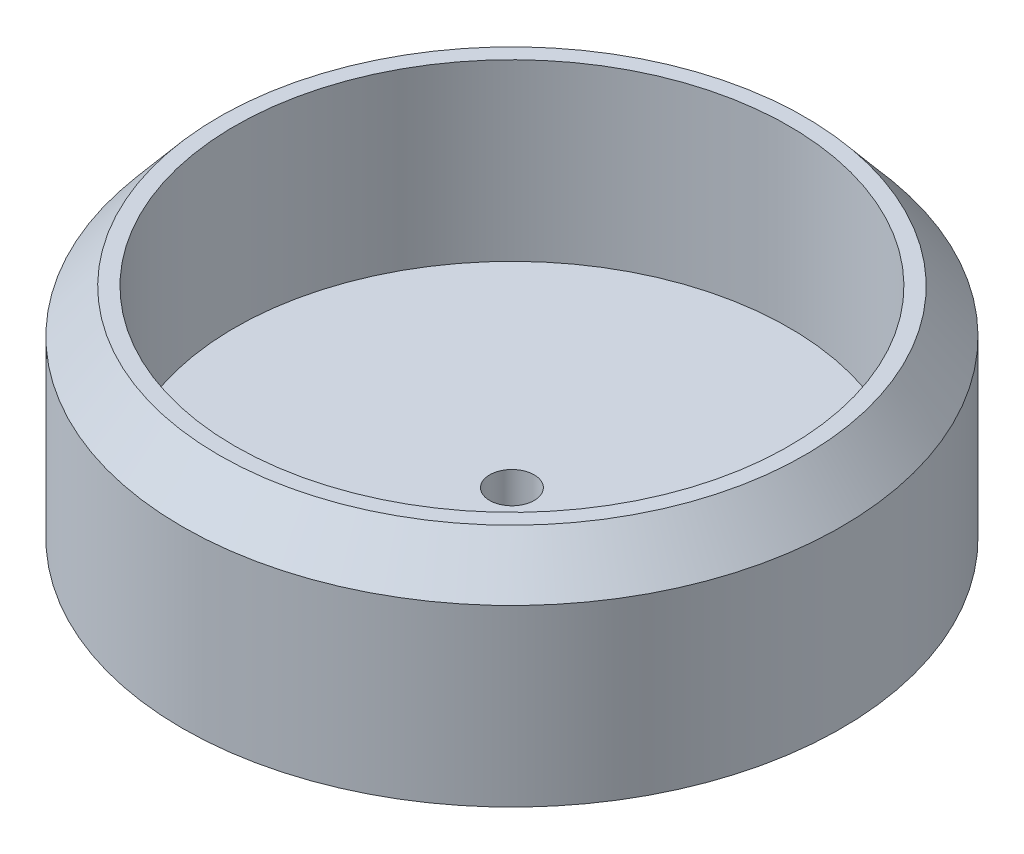
ISO-10303-21;
HEADER;
FILE_DESCRIPTION(('STEP AP214'),'2;1');
FILE_NAME('part.step','',(''),(''),'','','');
FILE_SCHEMA(('AUTOMOTIVE_DESIGN { 1 0 10303 214 1 1 1 1 }'));
ENDSEC;
DATA;
#1=APPLICATION_CONTEXT('core data for automotive mechanical design processes');
#2=APPLICATION_PROTOCOL_DEFINITION('international standard','automotive_design',2000,#1);
#3=PRODUCT_CONTEXT('',#1,'mechanical');
#4=PRODUCT('Part','Part','',(#3));
#5=PRODUCT_RELATED_PRODUCT_CATEGORY('part','',(#4));
#6=PRODUCT_DEFINITION_FORMATION('','',#4);
#7=PRODUCT_DEFINITION_CONTEXT('part definition',#1,'design');
#8=PRODUCT_DEFINITION('design','',#6,#7);
#9=PRODUCT_DEFINITION_SHAPE('','',#8);
#10=(LENGTH_UNIT() NAMED_UNIT(*) SI_UNIT(.MILLI.,.METRE.));
#11=(NAMED_UNIT(*) PLANE_ANGLE_UNIT() SI_UNIT($,.RADIAN.));
#12=(NAMED_UNIT(*) SI_UNIT($,.STERADIAN.) SOLID_ANGLE_UNIT());
#13=UNCERTAINTY_MEASURE_WITH_UNIT(LENGTH_MEASURE(1.E-05),#10,'distance_accuracy_value','');
#14=(GEOMETRIC_REPRESENTATION_CONTEXT(3) GLOBAL_UNCERTAINTY_ASSIGNED_CONTEXT((#13)) GLOBAL_UNIT_ASSIGNED_CONTEXT((#10,
#11,#12)) REPRESENTATION_CONTEXT('',''));
#15=CARTESIAN_POINT('',(0.,0.,0.));
#16=DIRECTION('',(0.,0.,1.));
#17=DIRECTION('',(1.,0.,0.));
#18=AXIS2_PLACEMENT_3D('',#15,#16,#17);
#19=CARTESIAN_POINT('',(0.,5.,0.));
#20=DIRECTION('',(0.,-1.,0.));
#21=DIRECTION('',(0.,0.,-1.));
#22=AXIS2_PLACEMENT_3D('',#19,#20,#21);
#23=CYLINDRICAL_SURFACE('',#22,37.75);
#24=CARTESIAN_POINT('',(0.,20.,0.));
#25=DIRECTION('',(0.,1.,0.));
#26=DIRECTION('',(0.,0.,1.));
#27=AXIS2_PLACEMENT_3D('',#24,#25,#26);
#28=CIRCLE('',#27,37.75);
#29=CARTESIAN_POINT('',(0.,20.,37.75));
#30=VERTEX_POINT('',#29);
#31=EDGE_CURVE('E10',#30,#30,#28,.F.);
#32=ORIENTED_EDGE('',*,*,#31,.T.);
#33=EDGE_LOOP('',(#32));
#34=FACE_BOUND('',#33,.T.);
#35=CARTESIAN_POINT('',(0.,0.,0.));
#36=DIRECTION('',(0.,1.,0.));
#37=DIRECTION('',(0.,0.,1.));
#38=AXIS2_PLACEMENT_3D('',#35,#36,#37);
#39=CIRCLE('',#38,37.75);
#40=CARTESIAN_POINT('',(0.,0.,37.75));
#41=VERTEX_POINT('',#40);
#42=EDGE_CURVE('E50',#41,#41,#39,.T.);
#43=ORIENTED_EDGE('',*,*,#42,.T.);
#44=EDGE_LOOP('',(#43));
#45=FACE_BOUND('',#44,.T.);
#46=ADVANCED_FACE('F33',(#34,#45),#23,.T.);
#47=CARTESIAN_POINT('',(0.,0.,0.));
#48=DIRECTION('',(0.,1.,0.));
#49=DIRECTION('',(0.,0.,1.));
#50=AXIS2_PLACEMENT_3D('',#47,#48,#49);
#51=PLANE('',#50);
#52=CARTESIAN_POINT('',(0.,0.,0.));
#53=DIRECTION('',(0.,1.,0.));
#54=DIRECTION('',(0.,0.,1.));
#55=AXIS2_PLACEMENT_3D('',#52,#53,#54);
#56=CIRCLE('',#55,2.55);
#57=CARTESIAN_POINT('',(0.,0.,2.55));
#58=VERTEX_POINT('',#57);
#59=EDGE_CURVE('E56',#58,#58,#56,.T.);
#60=ORIENTED_EDGE('',*,*,#59,.T.);
#61=EDGE_LOOP('',(#60));
#62=FACE_BOUND('',#61,.T.);
#63=ORIENTED_EDGE('',*,*,#42,.F.);
#64=EDGE_LOOP('',(#63));
#65=FACE_BOUND('',#64,.T.);
#66=ADVANCED_FACE('F81',(#62,#65),#51,.F.);
#67=CARTESIAN_POINT('',(0.,25.,0.));
#68=DIRECTION('',(0.,1.,0.));
#69=DIRECTION('',(0.,0.,1.));
#70=AXIS2_PLACEMENT_3D('',#67,#68,#69);
#71=PLANE('',#70);
#72=CARTESIAN_POINT('',(0.,25.,0.));
#73=DIRECTION('',(0.,1.,0.));
#74=DIRECTION('',(0.,0.,1.));
#75=AXIS2_PLACEMENT_3D('',#72,#73,#74);
#76=CIRCLE('',#75,33.5545018441136);
#77=CARTESIAN_POINT('',(0.,25.,33.5545018441136));
#78=VERTEX_POINT('',#77);
#79=EDGE_CURVE('E41',#78,#78,#76,.T.);
#80=ORIENTED_EDGE('',*,*,#79,.T.);
#81=EDGE_LOOP('',(#80));
#82=FACE_BOUND('',#81,.T.);
#83=CARTESIAN_POINT('',(0.,25.,0.));
#84=DIRECTION('',(0.,1.,0.));
#85=DIRECTION('',(0.,0.,1.));
#86=AXIS2_PLACEMENT_3D('',#83,#84,#85);
#87=CIRCLE('',#86,31.7505);
#88=CARTESIAN_POINT('',(0.,25.,31.7505));
#89=VERTEX_POINT('',#88);
#90=EDGE_CURVE('E53',#89,#89,#87,.T.);
#91=ORIENTED_EDGE('',*,*,#90,.F.);
#92=EDGE_LOOP('',(#91));
#93=FACE_BOUND('',#92,.T.);
#94=ADVANCED_FACE('F74',(#82,#93),#71,.T.);
#95=CARTESIAN_POINT('',(0.,25.,0.));
#96=DIRECTION('',(0.,-1.,0.));
#97=DIRECTION('',(0.,0.,-1.));
#98=AXIS2_PLACEMENT_3D('',#95,#96,#97);
#99=CYLINDRICAL_SURFACE('',#98,31.7505);
#100=ORIENTED_EDGE('',*,*,#90,.T.);
#101=EDGE_LOOP('',(#100));
#102=FACE_BOUND('',#101,.T.);
#103=CARTESIAN_POINT('',(0.,5.,0.));
#104=DIRECTION('',(0.,1.,0.));
#105=DIRECTION('',(0.,0.,1.));
#106=AXIS2_PLACEMENT_3D('',#103,#104,#105);
#107=CIRCLE('',#106,31.7505);
#108=CARTESIAN_POINT('',(0.,5.,31.7505));
#109=VERTEX_POINT('',#108);
#110=EDGE_CURVE('E45',#109,#109,#107,.F.);
#111=ORIENTED_EDGE('',*,*,#110,.T.);
#112=EDGE_LOOP('',(#111));
#113=FACE_BOUND('',#112,.T.);
#114=ADVANCED_FACE('F69',(#102,#113),#99,.F.);
#115=CARTESIAN_POINT('',(0.,5.,0.));
#116=DIRECTION('',(0.,1.,0.));
#117=DIRECTION('',(0.,0.,1.));
#118=AXIS2_PLACEMENT_3D('',#115,#116,#117);
#119=PLANE('',#118);
#120=CARTESIAN_POINT('',(0.,5.,0.));
#121=DIRECTION('',(0.,1.,0.));
#122=DIRECTION('',(0.,0.,1.));
#123=AXIS2_PLACEMENT_3D('',#120,#121,#122);
#124=CIRCLE('',#123,2.55);
#125=CARTESIAN_POINT('',(0.,5.,2.55));
#126=VERTEX_POINT('',#125);
#127=EDGE_CURVE('E37',#126,#126,#124,.T.);
#128=ORIENTED_EDGE('',*,*,#127,.F.);
#129=EDGE_LOOP('',(#128));
#130=FACE_BOUND('',#129,.T.);
#131=ORIENTED_EDGE('',*,*,#110,.F.);
#132=EDGE_LOOP('',(#131));
#133=FACE_BOUND('',#132,.T.);
#134=ADVANCED_FACE('F66',(#130,#133),#119,.T.);
#135=CARTESIAN_POINT('',(0.,25.,0.));
#136=DIRECTION('',(0.,-1.,0.));
#137=DIRECTION('',(0.,0.,-1.));
#138=AXIS2_PLACEMENT_3D('',#135,#136,#137);
#139=CONICAL_SURFACE('',#138,33.5545018441136,0.698131700797728);
#140=ORIENTED_EDGE('',*,*,#31,.F.);
#141=EDGE_LOOP('',(#140));
#142=FACE_BOUND('',#141,.T.);
#143=ORIENTED_EDGE('',*,*,#79,.F.);
#144=EDGE_LOOP('',(#143));
#145=FACE_BOUND('',#144,.T.);
#146=ADVANCED_FACE('F35',(#142,#145),#139,.T.);
#147=CARTESIAN_POINT('',(0.,25.,0.));
#148=DIRECTION('',(0.,-1.,0.));
#149=DIRECTION('',(0.,0.,-1.));
#150=AXIS2_PLACEMENT_3D('',#147,#148,#149);
#151=CYLINDRICAL_SURFACE('',#150,2.55);
#152=ORIENTED_EDGE('',*,*,#127,.T.);
#153=EDGE_LOOP('',(#152));
#154=FACE_BOUND('',#153,.T.);
#155=ORIENTED_EDGE('',*,*,#59,.F.);
#156=EDGE_LOOP('',(#155));
#157=FACE_BOUND('',#156,.T.);
#158=ADVANCED_FACE('F63',(#154,#157),#151,.F.);
#159=CLOSED_SHELL('',(#46,#66,#94,#114,#134,#146,#158));
#160=MANIFOLD_SOLID_BREP('B2',#159);
#161=ADVANCED_BREP_SHAPE_REPRESENTATION('',(#18,#160),#14);
#162=SHAPE_DEFINITION_REPRESENTATION(#9,#161);
ENDSEC;
END-ISO-10303-21;
